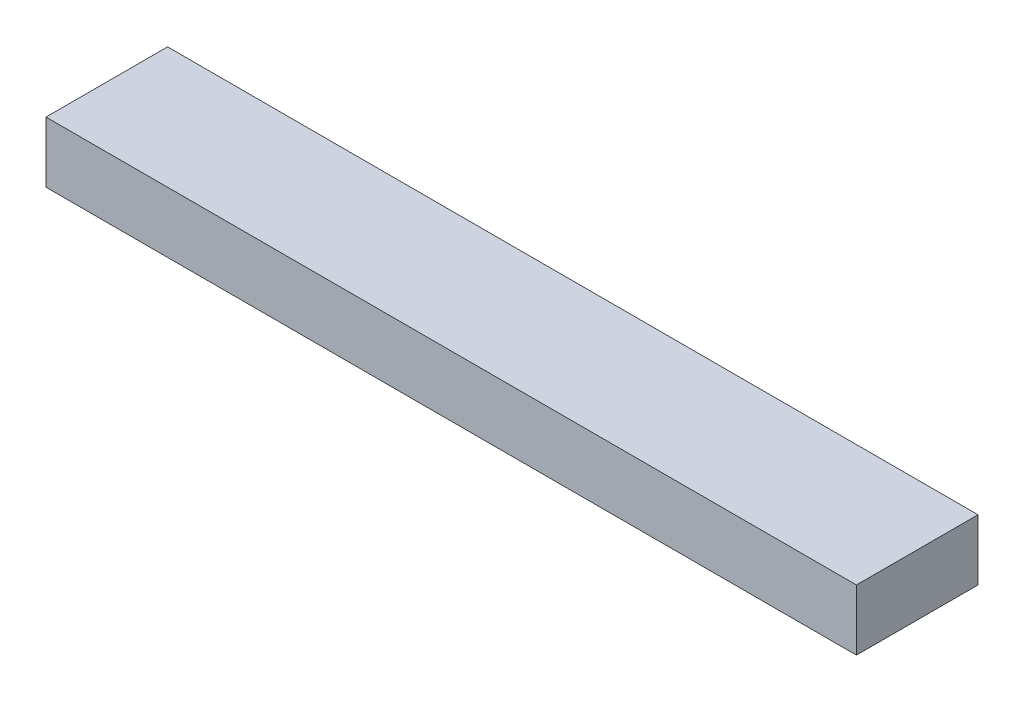
ISO-10303-21;
HEADER;
FILE_DESCRIPTION(('STEP AP214'),'2;1');
FILE_NAME('part.step','',(''),(''),'','','');
FILE_SCHEMA(('AUTOMOTIVE_DESIGN { 1 0 10303 214 1 1 1 1 }'));
ENDSEC;
DATA;
#1=APPLICATION_CONTEXT('core data for automotive mechanical design processes');
#2=APPLICATION_PROTOCOL_DEFINITION('international standard','automotive_design',2000,#1);
#3=PRODUCT_CONTEXT('',#1,'mechanical');
#4=PRODUCT('Part','Part','',(#3));
#5=PRODUCT_RELATED_PRODUCT_CATEGORY('part','',(#4));
#6=PRODUCT_DEFINITION_FORMATION('','',#4);
#7=PRODUCT_DEFINITION_CONTEXT('part definition',#1,'design');
#8=PRODUCT_DEFINITION('design','',#6,#7);
#9=PRODUCT_DEFINITION_SHAPE('','',#8);
#10=(LENGTH_UNIT() NAMED_UNIT(*) SI_UNIT(.MILLI.,.METRE.));
#11=(NAMED_UNIT(*) PLANE_ANGLE_UNIT() SI_UNIT($,.RADIAN.));
#12=(NAMED_UNIT(*) SI_UNIT($,.STERADIAN.) SOLID_ANGLE_UNIT());
#13=UNCERTAINTY_MEASURE_WITH_UNIT(LENGTH_MEASURE(1.E-05),#10,'distance_accuracy_value','');
#14=(GEOMETRIC_REPRESENTATION_CONTEXT(3) GLOBAL_UNCERTAINTY_ASSIGNED_CONTEXT((#13)) GLOBAL_UNIT_ASSIGNED_CONTEXT((#10,
#11,#12)) REPRESENTATION_CONTEXT('',''));
#15=CARTESIAN_POINT('',(0.,0.,0.));
#16=DIRECTION('',(0.,0.,1.));
#17=DIRECTION('',(1.,0.,0.));
#18=AXIS2_PLACEMENT_3D('',#15,#16,#17);
#19=CARTESIAN_POINT('',(1000.,75.,-150.));
#20=DIRECTION('',(-1.,0.,0.));
#21=DIRECTION('',(0.,0.,1.));
#22=AXIS2_PLACEMENT_3D('',#19,#20,#21);
#23=PLANE('',#22);
#24=DIRECTION('',(0.,0.,-1.));
#25=VECTOR('',#24,1.);
#26=CARTESIAN_POINT('',(1000.,-75.,-150.));
#27=LINE('',#26,#25);
#28=CARTESIAN_POINT('',(1000.,-75.,150.));
#29=VERTEX_POINT('',#28);
#30=CARTESIAN_POINT('',(1000.,-75.,-150.));
#31=VERTEX_POINT('',#30);
#32=EDGE_CURVE('E96',#29,#31,#27,.T.);
#33=ORIENTED_EDGE('',*,*,#32,.T.);
#34=DIRECTION('',(0.,-1.,0.));
#35=VECTOR('',#34,1.);
#36=CARTESIAN_POINT('',(1000.,75.,-150.));
#37=LINE('',#36,#35);
#38=CARTESIAN_POINT('',(1000.,75.,-150.));
#39=VERTEX_POINT('',#38);
#40=EDGE_CURVE('E11',#39,#31,#37,.T.);
#41=ORIENTED_EDGE('',*,*,#40,.F.);
#42=DIRECTION('',(0.,0.,-1.));
#43=VECTOR('',#42,1.);
#44=CARTESIAN_POINT('',(1000.,75.,-150.));
#45=LINE('',#44,#43);
#46=CARTESIAN_POINT('',(1000.,75.,150.));
#47=VERTEX_POINT('',#46);
#48=EDGE_CURVE('E84',#47,#39,#45,.T.);
#49=ORIENTED_EDGE('',*,*,#48,.F.);
#50=DIRECTION('',(0.,-1.,0.));
#51=VECTOR('',#50,1.);
#52=CARTESIAN_POINT('',(1000.,75.,150.));
#53=LINE('',#52,#51);
#54=EDGE_CURVE('E92',#47,#29,#53,.T.);
#55=ORIENTED_EDGE('',*,*,#54,.T.);
#56=EDGE_LOOP('',(#33,#41,#49,#55));
#57=FACE_BOUND('',#56,.T.);
#58=ADVANCED_FACE('F33',(#57),#23,.F.);
#59=CARTESIAN_POINT('',(-1000.,75.,-150.));
#60=DIRECTION('',(0.,0.,1.));
#61=DIRECTION('',(1.,0.,0.));
#62=AXIS2_PLACEMENT_3D('',#59,#60,#61);
#63=PLANE('',#62);
#64=DIRECTION('',(-1.,0.,0.));
#65=VECTOR('',#64,1.);
#66=CARTESIAN_POINT('',(-1000.,-75.,-150.));
#67=LINE('',#66,#65);
#68=CARTESIAN_POINT('',(-1000.,-75.,-150.));
#69=VERTEX_POINT('',#68);
#70=EDGE_CURVE('E88',#31,#69,#67,.T.);
#71=ORIENTED_EDGE('',*,*,#70,.T.);
#72=DIRECTION('',(0.,-1.,0.));
#73=VECTOR('',#72,1.);
#74=CARTESIAN_POINT('',(-1000.,75.,-150.));
#75=LINE('',#74,#73);
#76=CARTESIAN_POINT('',(-1000.,75.,-150.));
#77=VERTEX_POINT('',#76);
#78=EDGE_CURVE('E41',#77,#69,#75,.T.);
#79=ORIENTED_EDGE('',*,*,#78,.F.);
#80=DIRECTION('',(-1.,0.,0.));
#81=VECTOR('',#80,1.);
#82=CARTESIAN_POINT('',(-1000.,75.,-150.));
#83=LINE('',#82,#81);
#84=EDGE_CURVE('E79',#39,#77,#83,.T.);
#85=ORIENTED_EDGE('',*,*,#84,.F.);
#86=ORIENTED_EDGE('',*,*,#40,.T.);
#87=EDGE_LOOP('',(#71,#79,#85,#86));
#88=FACE_BOUND('',#87,.T.);
#89=ADVANCED_FACE('F87',(#88),#63,.F.);
#90=CARTESIAN_POINT('',(-1000.,75.,-150.));
#91=DIRECTION('',(1.,0.,0.));
#92=DIRECTION('',(0.,0.,-1.));
#93=AXIS2_PLACEMENT_3D('',#90,#91,#92);
#94=PLANE('',#93);
#95=DIRECTION('',(0.,0.,1.));
#96=VECTOR('',#95,1.);
#97=CARTESIAN_POINT('',(-1000.,-75.,-150.));
#98=LINE('',#97,#96);
#99=CARTESIAN_POINT('',(-1000.,-75.,150.));
#100=VERTEX_POINT('',#99);
#101=EDGE_CURVE('E66',#69,#100,#98,.T.);
#102=ORIENTED_EDGE('',*,*,#101,.T.);
#103=DIRECTION('',(0.,-1.,0.));
#104=VECTOR('',#103,1.);
#105=CARTESIAN_POINT('',(-1000.,75.,150.));
#106=LINE('',#105,#104);
#107=CARTESIAN_POINT('',(-1000.,75.,150.));
#108=VERTEX_POINT('',#107);
#109=EDGE_CURVE('E89',#108,#100,#106,.T.);
#110=ORIENTED_EDGE('',*,*,#109,.F.);
#111=DIRECTION('',(0.,0.,1.));
#112=VECTOR('',#111,1.);
#113=CARTESIAN_POINT('',(-1000.,75.,-150.));
#114=LINE('',#113,#112);
#115=EDGE_CURVE('E82',#77,#108,#114,.T.);
#116=ORIENTED_EDGE('',*,*,#115,.F.);
#117=ORIENTED_EDGE('',*,*,#78,.T.);
#118=EDGE_LOOP('',(#102,#110,#116,#117));
#119=FACE_BOUND('',#118,.T.);
#120=ADVANCED_FACE('F90',(#119),#94,.F.);
#121=CARTESIAN_POINT('',(-1000.,75.,150.));
#122=DIRECTION('',(0.,0.,-1.));
#123=DIRECTION('',(-1.,0.,0.));
#124=AXIS2_PLACEMENT_3D('',#121,#122,#123);
#125=PLANE('',#124);
#126=DIRECTION('',(1.,0.,0.));
#127=VECTOR('',#126,1.);
#128=CARTESIAN_POINT('',(-1000.,-75.,150.));
#129=LINE('',#128,#127);
#130=EDGE_CURVE('E72',#100,#29,#129,.T.);
#131=ORIENTED_EDGE('',*,*,#130,.T.);
#132=ORIENTED_EDGE('',*,*,#54,.F.);
#133=DIRECTION('',(1.,0.,0.));
#134=VECTOR('',#133,1.);
#135=CARTESIAN_POINT('',(-1000.,75.,150.));
#136=LINE('',#135,#134);
#137=EDGE_CURVE('E49',#108,#47,#136,.T.);
#138=ORIENTED_EDGE('',*,*,#137,.F.);
#139=ORIENTED_EDGE('',*,*,#109,.T.);
#140=EDGE_LOOP('',(#131,#132,#138,#139));
#141=FACE_BOUND('',#140,.T.);
#142=ADVANCED_FACE('F103',(#141),#125,.F.);
#143=CARTESIAN_POINT('',(0.,75.,0.));
#144=DIRECTION('',(0.,1.,0.));
#145=DIRECTION('',(0.,0.,1.));
#146=AXIS2_PLACEMENT_3D('',#143,#144,#145);
#147=PLANE('',#146);
#148=ORIENTED_EDGE('',*,*,#48,.T.);
#149=ORIENTED_EDGE('',*,*,#84,.T.);
#150=ORIENTED_EDGE('',*,*,#115,.T.);
#151=ORIENTED_EDGE('',*,*,#137,.T.);
#152=EDGE_LOOP('',(#148,#149,#150,#151));
#153=FACE_BOUND('',#152,.T.);
#154=ADVANCED_FACE('F80',(#153),#147,.T.);
#155=CARTESIAN_POINT('',(0.,-75.,0.));
#156=DIRECTION('',(0.,1.,0.));
#157=DIRECTION('',(0.,0.,1.));
#158=AXIS2_PLACEMENT_3D('',#155,#156,#157);
#159=PLANE('',#158);
#160=ORIENTED_EDGE('',*,*,#32,.F.);
#161=ORIENTED_EDGE('',*,*,#130,.F.);
#162=ORIENTED_EDGE('',*,*,#101,.F.);
#163=ORIENTED_EDGE('',*,*,#70,.F.);
#164=EDGE_LOOP('',(#160,#161,#162,#163));
#165=FACE_BOUND('',#164,.T.);
#166=ADVANCED_FACE('F106',(#165),#159,.F.);
#167=CLOSED_SHELL('',(#58,#89,#120,#142,#154,#166));
#168=MANIFOLD_SOLID_BREP('B2',#167);
#169=ADVANCED_BREP_SHAPE_REPRESENTATION('',(#18,#168),#14);
#170=SHAPE_DEFINITION_REPRESENTATION(#9,#169);
ENDSEC;
END-ISO-10303-21;
